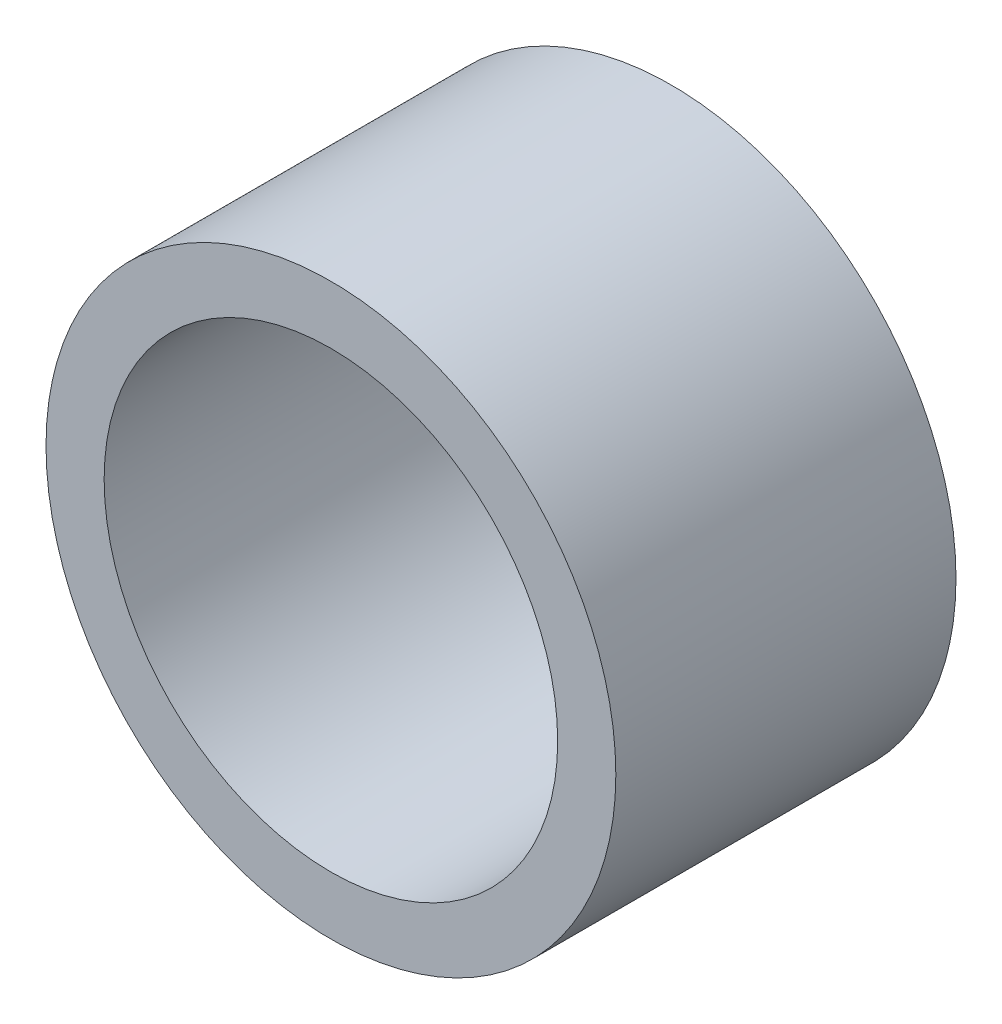
ISO-10303-21;
HEADER;
FILE_DESCRIPTION(('STEP AP214'),'2;1');
FILE_NAME('part.step','',(''),(''),'','','');
FILE_SCHEMA(('AUTOMOTIVE_DESIGN { 1 0 10303 214 1 1 1 1 }'));
ENDSEC;
DATA;
#1=APPLICATION_CONTEXT('core data for automotive mechanical design processes');
#2=APPLICATION_PROTOCOL_DEFINITION('international standard','automotive_design',2000,#1);
#3=PRODUCT_CONTEXT('',#1,'mechanical');
#4=PRODUCT('Part','Part','',(#3));
#5=PRODUCT_RELATED_PRODUCT_CATEGORY('part','',(#4));
#6=PRODUCT_DEFINITION_FORMATION('','',#4);
#7=PRODUCT_DEFINITION_CONTEXT('part definition',#1,'design');
#8=PRODUCT_DEFINITION('design','',#6,#7);
#9=PRODUCT_DEFINITION_SHAPE('','',#8);
#10=(LENGTH_UNIT() NAMED_UNIT(*) SI_UNIT(.MILLI.,.METRE.));
#11=(NAMED_UNIT(*) PLANE_ANGLE_UNIT() SI_UNIT($,.RADIAN.));
#12=(NAMED_UNIT(*) SI_UNIT($,.STERADIAN.) SOLID_ANGLE_UNIT());
#13=UNCERTAINTY_MEASURE_WITH_UNIT(LENGTH_MEASURE(1.E-05),#10,'distance_accuracy_value','');
#14=(GEOMETRIC_REPRESENTATION_CONTEXT(3) GLOBAL_UNCERTAINTY_ASSIGNED_CONTEXT((#13)) GLOBAL_UNIT_ASSIGNED_CONTEXT((#10,
#11,#12)) REPRESENTATION_CONTEXT('',''));
#15=CARTESIAN_POINT('',(0.,0.,0.));
#16=DIRECTION('',(0.,0.,1.));
#17=DIRECTION('',(1.,0.,0.));
#18=AXIS2_PLACEMENT_3D('',#15,#16,#17);
#19=CARTESIAN_POINT('',(0.,0.,3.));
#20=DIRECTION('',(0.,0.,1.));
#21=DIRECTION('',(1.,0.,0.));
#22=AXIS2_PLACEMENT_3D('',#19,#20,#21);
#23=PLANE('',#22);
#24=CARTESIAN_POINT('',(0.,0.,3.));
#25=DIRECTION('',(0.,0.,1.));
#26=DIRECTION('',(1.,0.,0.));
#27=AXIS2_PLACEMENT_3D('',#24,#25,#26);
#28=CIRCLE('',#27,5.0255);
#29=CARTESIAN_POINT('',(5.0255,0.,3.));
#30=VERTEX_POINT('',#29);
#31=EDGE_CURVE('E10',#30,#30,#28,.T.);
#32=ORIENTED_EDGE('',*,*,#31,.T.);
#33=EDGE_LOOP('',(#32));
#34=FACE_BOUND('',#33,.T.);
#35=CARTESIAN_POINT('',(0.,0.,3.));
#36=DIRECTION('',(0.,0.,1.));
#37=DIRECTION('',(1.,0.,0.));
#38=AXIS2_PLACEMENT_3D('',#35,#36,#37);
#39=CIRCLE('',#38,4.);
#40=CARTESIAN_POINT('',(4.,0.,3.));
#41=VERTEX_POINT('',#40);
#42=EDGE_CURVE('E37',#41,#41,#39,.T.);
#43=ORIENTED_EDGE('',*,*,#42,.F.);
#44=EDGE_LOOP('',(#43));
#45=FACE_BOUND('',#44,.T.);
#46=ADVANCED_FACE('F30',(#34,#45),#23,.T.);
#47=CARTESIAN_POINT('',(0.,0.,3.));
#48=DIRECTION('',(0.,0.,-1.));
#49=DIRECTION('',(-1.,0.,0.));
#50=AXIS2_PLACEMENT_3D('',#47,#48,#49);
#51=CYLINDRICAL_SURFACE('',#50,5.0255);
#52=ORIENTED_EDGE('',*,*,#31,.F.);
#53=EDGE_LOOP('',(#52));
#54=FACE_BOUND('',#53,.T.);
#55=CARTESIAN_POINT('',(0.,0.,-3.));
#56=DIRECTION('',(0.,0.,1.));
#57=DIRECTION('',(1.,0.,0.));
#58=AXIS2_PLACEMENT_3D('',#55,#56,#57);
#59=CIRCLE('',#58,5.0255);
#60=CARTESIAN_POINT('',(5.0255,0.,-3.));
#61=VERTEX_POINT('',#60);
#62=EDGE_CURVE('E41',#61,#61,#59,.T.);
#63=ORIENTED_EDGE('',*,*,#62,.T.);
#64=EDGE_LOOP('',(#63));
#65=FACE_BOUND('',#64,.T.);
#66=ADVANCED_FACE('F32',(#54,#65),#51,.T.);
#67=CARTESIAN_POINT('',(0.,0.,3.));
#68=DIRECTION('',(0.,0.,-1.));
#69=DIRECTION('',(-1.,0.,0.));
#70=AXIS2_PLACEMENT_3D('',#67,#68,#69);
#71=CYLINDRICAL_SURFACE('',#70,4.);
#72=ORIENTED_EDGE('',*,*,#42,.T.);
#73=EDGE_LOOP('',(#72));
#74=FACE_BOUND('',#73,.T.);
#75=CARTESIAN_POINT('',(0.,0.,-3.));
#76=DIRECTION('',(0.,0.,1.));
#77=DIRECTION('',(1.,0.,0.));
#78=AXIS2_PLACEMENT_3D('',#75,#76,#77);
#79=CIRCLE('',#78,4.);
#80=CARTESIAN_POINT('',(4.,0.,-3.));
#81=VERTEX_POINT('',#80);
#82=EDGE_CURVE('E45',#81,#81,#79,.T.);
#83=ORIENTED_EDGE('',*,*,#82,.F.);
#84=EDGE_LOOP('',(#83));
#85=FACE_BOUND('',#84,.T.);
#86=ADVANCED_FACE('F54',(#74,#85),#71,.F.);
#87=CARTESIAN_POINT('',(0.,0.,-3.));
#88=DIRECTION('',(0.,0.,1.));
#89=DIRECTION('',(1.,0.,0.));
#90=AXIS2_PLACEMENT_3D('',#87,#88,#89);
#91=PLANE('',#90);
#92=ORIENTED_EDGE('',*,*,#82,.T.);
#93=EDGE_LOOP('',(#92));
#94=FACE_BOUND('',#93,.T.);
#95=ORIENTED_EDGE('',*,*,#62,.F.);
#96=EDGE_LOOP('',(#95));
#97=FACE_BOUND('',#96,.T.);
#98=ADVANCED_FACE('F51',(#94,#97),#91,.F.);
#99=CLOSED_SHELL('',(#46,#66,#86,#98));
#100=MANIFOLD_SOLID_BREP('B2',#99);
#101=ADVANCED_BREP_SHAPE_REPRESENTATION('',(#18,#100),#14);
#102=SHAPE_DEFINITION_REPRESENTATION(#9,#101);
ENDSEC;
END-ISO-10303-21;
